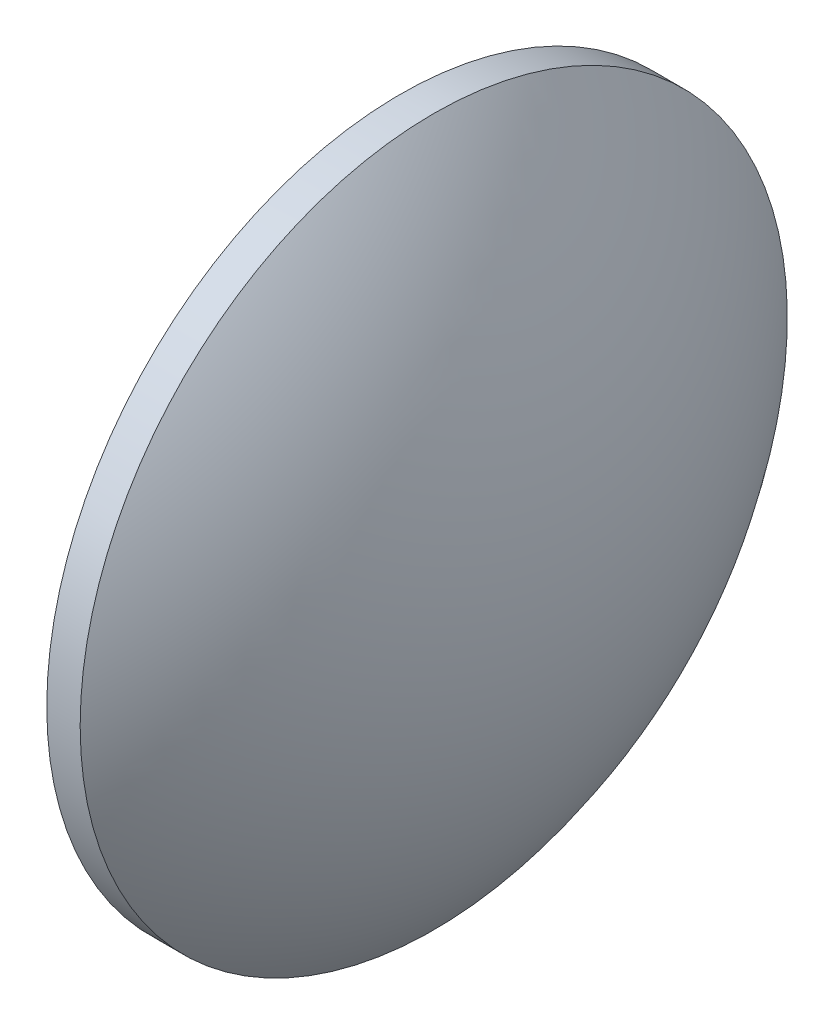
ISO-10303-21;
HEADER;
FILE_DESCRIPTION(('STEP AP214'),'2;1');
FILE_NAME('part.step','',(''),(''),'','','');
FILE_SCHEMA(('AUTOMOTIVE_DESIGN { 1 0 10303 214 1 1 1 1 }'));
ENDSEC;
DATA;
#1=APPLICATION_CONTEXT('core data for automotive mechanical design processes');
#2=APPLICATION_PROTOCOL_DEFINITION('international standard','automotive_design',2000,#1);
#3=PRODUCT_CONTEXT('',#1,'mechanical');
#4=PRODUCT('Part','Part','',(#3));
#5=PRODUCT_RELATED_PRODUCT_CATEGORY('part','',(#4));
#6=PRODUCT_DEFINITION_FORMATION('','',#4);
#7=PRODUCT_DEFINITION_CONTEXT('part definition',#1,'design');
#8=PRODUCT_DEFINITION('design','',#6,#7);
#9=PRODUCT_DEFINITION_SHAPE('','',#8);
#10=(LENGTH_UNIT() NAMED_UNIT(*) SI_UNIT(.MILLI.,.METRE.));
#11=(NAMED_UNIT(*) PLANE_ANGLE_UNIT() SI_UNIT($,.RADIAN.));
#12=(NAMED_UNIT(*) SI_UNIT($,.STERADIAN.) SOLID_ANGLE_UNIT());
#13=UNCERTAINTY_MEASURE_WITH_UNIT(LENGTH_MEASURE(1.E-05),#10,'distance_accuracy_value','');
#14=(GEOMETRIC_REPRESENTATION_CONTEXT(3) GLOBAL_UNCERTAINTY_ASSIGNED_CONTEXT((#13)) GLOBAL_UNIT_ASSIGNED_CONTEXT((#10,
#11,#12)) REPRESENTATION_CONTEXT('',''));
#15=CARTESIAN_POINT('',(0.,0.,0.));
#16=DIRECTION('',(0.,0.,1.));
#17=DIRECTION('',(1.,0.,0.));
#18=AXIS2_PLACEMENT_3D('',#15,#16,#17);
#19=CARTESIAN_POINT('',(358.724358263427,55.9226815912759,0.));
#20=DIRECTION('',(-1.,0.,0.));
#21=DIRECTION('',(0.,1.,0.));
#22=AXIS2_PLACEMENT_3D('',#19,#20,#21);
#23=SPHERICAL_SURFACE('',#22,28.8642857142857);
#24=CARTESIAN_POINT('',(381.288643977712,55.9226815912759,0.));
#25=DIRECTION('',(-1.,0.,0.));
#26=DIRECTION('',(0.,0.,1.));
#27=AXIS2_PLACEMENT_3D('',#24,#25,#26);
#28=CIRCLE('',#27,18.);
#29=CARTESIAN_POINT('',(381.288643977712,55.9226815912759,18.));
#30=VERTEX_POINT('',#29);
#31=EDGE_CURVE('E10',#30,#30,#28,.T.);
#32=ORIENTED_EDGE('',*,*,#31,.F.);
#33=EDGE_LOOP('',(#32));
#34=FACE_BOUND('',#33,.T.);
#35=ADVANCED_FACE('F33',(#34),#23,.T.);
#36=CARTESIAN_POINT('',(374.010727678608,55.9226815912759,0.));
#37=DIRECTION('',(-1.,0.,0.));
#38=DIRECTION('',(0.,0.,1.));
#39=AXIS2_PLACEMENT_3D('',#36,#37,#38);
#40=CYLINDRICAL_SURFACE('',#39,18.);
#41=CARTESIAN_POINT('',(379.588643977712,55.9226815912759,0.));
#42=DIRECTION('',(-1.,0.,0.));
#43=DIRECTION('',(0.,0.,1.));
#44=AXIS2_PLACEMENT_3D('',#41,#42,#43);
#45=CIRCLE('',#44,18.);
#46=CARTESIAN_POINT('',(379.588643977712,55.9226815912759,18.));
#47=VERTEX_POINT('',#46);
#48=EDGE_CURVE('E39',#47,#47,#45,.T.);
#49=ORIENTED_EDGE('',*,*,#48,.F.);
#50=EDGE_LOOP('',(#49));
#51=FACE_BOUND('',#50,.T.);
#52=ORIENTED_EDGE('',*,*,#31,.T.);
#53=EDGE_LOOP('',(#52));
#54=FACE_BOUND('',#53,.T.);
#55=ADVANCED_FACE('F47',(#51,#54),#40,.T.);
#56=CARTESIAN_POINT('',(379.588643977712,55.9226815912759,0.));
#57=DIRECTION('',(1.,0.,0.));
#58=DIRECTION('',(0.,0.,-1.));
#59=AXIS2_PLACEMENT_3D('',#56,#57,#58);
#60=PLANE('',#59);
#61=ORIENTED_EDGE('',*,*,#48,.T.);
#62=EDGE_LOOP('',(#61));
#63=FACE_BOUND('',#62,.T.);
#64=ADVANCED_FACE('F45',(#63),#60,.F.);
#65=CLOSED_SHELL('',(#35,#55,#64));
#66=MANIFOLD_SOLID_BREP('B2',#65);
#67=ADVANCED_BREP_SHAPE_REPRESENTATION('',(#18,#66),#14);
#68=SHAPE_DEFINITION_REPRESENTATION(#9,#67);
ENDSEC;
END-ISO-10303-21;
